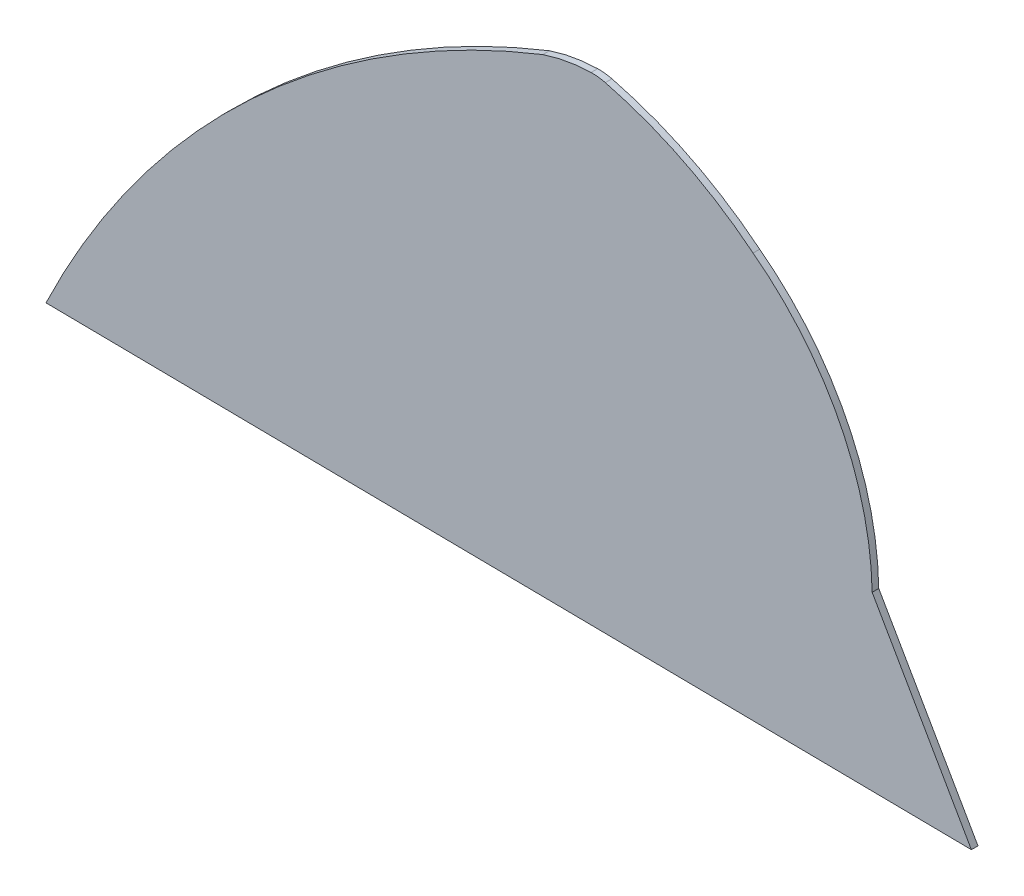
ISO-10303-21;
HEADER;
FILE_DESCRIPTION(('STEP AP214'),'2;1');
FILE_NAME('part.step','',(''),(''),'','','');
FILE_SCHEMA(('AUTOMOTIVE_DESIGN { 1 0 10303 214 1 1 1 1 }'));
ENDSEC;
DATA;
#1=APPLICATION_CONTEXT('core data for automotive mechanical design processes');
#2=APPLICATION_PROTOCOL_DEFINITION('international standard','automotive_design',2000,#1);
#3=PRODUCT_CONTEXT('',#1,'mechanical');
#4=PRODUCT('Part','Part','',(#3));
#5=PRODUCT_RELATED_PRODUCT_CATEGORY('part','',(#4));
#6=PRODUCT_DEFINITION_FORMATION('','',#4);
#7=PRODUCT_DEFINITION_CONTEXT('part definition',#1,'design');
#8=PRODUCT_DEFINITION('design','',#6,#7);
#9=PRODUCT_DEFINITION_SHAPE('','',#8);
#10=(LENGTH_UNIT() NAMED_UNIT(*) SI_UNIT(.MILLI.,.METRE.));
#11=(NAMED_UNIT(*) PLANE_ANGLE_UNIT() SI_UNIT($,.RADIAN.));
#12=(NAMED_UNIT(*) SI_UNIT($,.STERADIAN.) SOLID_ANGLE_UNIT());
#13=UNCERTAINTY_MEASURE_WITH_UNIT(LENGTH_MEASURE(1.E-05),#10,'distance_accuracy_value','');
#14=(GEOMETRIC_REPRESENTATION_CONTEXT(3) GLOBAL_UNCERTAINTY_ASSIGNED_CONTEXT((#13)) GLOBAL_UNIT_ASSIGNED_CONTEXT((#10,
#11,#12)) REPRESENTATION_CONTEXT('',''));
#15=CARTESIAN_POINT('',(0.,0.,0.));
#16=DIRECTION('',(0.,0.,1.));
#17=DIRECTION('',(1.,0.,0.));
#18=AXIS2_PLACEMENT_3D('',#15,#16,#17);
#19=CARTESIAN_POINT('',(535.988635979813,-603.910391378545,10.));
#20=DIRECTION('',(0.,0.,-1.));
#21=DIRECTION('',(-1.,0.,0.));
#22=AXIS2_PLACEMENT_3D('',#19,#20,#21);
#23=CYLINDRICAL_SURFACE('',#22,1410.55303377677);
#24=CARTESIAN_POINT('',(535.988635979813,-603.910391378545,0.));
#25=DIRECTION('',(0.,0.,1.));
#26=DIRECTION('',(1.,0.,0.));
#27=AXIS2_PLACEMENT_3D('',#24,#25,#26);
#28=CIRCLE('',#27,1410.55303377677);
#29=CARTESIAN_POINT('',(-735.852954333982,6.07225611638478,0.));
#30=VERTEX_POINT('',#29);
#31=CARTESIAN_POINT('',(15.9002478846662,707.260051266284,0.));
#32=VERTEX_POINT('',#31);
#33=EDGE_CURVE('E127',#30,#32,#28,.F.);
#34=ORIENTED_EDGE('',*,*,#33,.F.);
#35=DIRECTION('',(0.,0.,-1.));
#36=VECTOR('',#35,1.);
#37=CARTESIAN_POINT('',(-735.852954333982,6.07225611638478,10.));
#38=LINE('',#37,#36);
#39=CARTESIAN_POINT('',(-735.852954333982,6.07225611638478,10.));
#40=VERTEX_POINT('',#39);
#41=EDGE_CURVE('E12',#40,#30,#38,.T.);
#42=ORIENTED_EDGE('',*,*,#41,.F.);
#43=CARTESIAN_POINT('',(535.988635979813,-603.910391378545,10.));
#44=DIRECTION('',(0.,0.,1.));
#45=DIRECTION('',(1.,0.,0.));
#46=AXIS2_PLACEMENT_3D('',#43,#44,#45);
#47=CIRCLE('',#46,1410.55303377677);
#48=CARTESIAN_POINT('',(15.9002478846662,707.260051266284,10.));
#49=VERTEX_POINT('',#48);
#50=EDGE_CURVE('E143',#40,#49,#47,.F.);
#51=ORIENTED_EDGE('',*,*,#50,.T.);
#52=DIRECTION('',(0.,0.,-1.));
#53=VECTOR('',#52,1.);
#54=CARTESIAN_POINT('',(15.9002478846662,707.260051266284,10.));
#55=LINE('',#54,#53);
#56=EDGE_CURVE('E53',#49,#32,#55,.T.);
#57=ORIENTED_EDGE('',*,*,#56,.T.);
#58=EDGE_LOOP('',(#34,#42,#51,#57));
#59=FACE_BOUND('',#58,.T.);
#60=ADVANCED_FACE('F37',(#59),#23,.T.);
#61=CARTESIAN_POINT('',(-0.0306658305550728,-2.60148448646122,10.));
#62=DIRECTION('',(0.0117870009937492,0.999930530890808,0.));
#63=DIRECTION('',(-0.999930530890808,0.0117870009937492,0.));
#64=AXIS2_PLACEMENT_3D('',#61,#62,#63);
#65=PLANE('',#64);
#66=DIRECTION('',(0.999930530890808,-0.0117870009937492,0.));
#67=VECTOR('',#66,1.);
#68=CARTESIAN_POINT('',(-0.0306658305550728,-2.60148448646122,0.));
#69=LINE('',#68,#67);
#70=CARTESIAN_POINT('',(664.147045666018,-10.4306917199496,0.));
#71=VERTEX_POINT('',#70);
#72=EDGE_CURVE('E129',#30,#71,#69,.T.);
#73=ORIENTED_EDGE('',*,*,#72,.T.);
#74=DIRECTION('',(0.,0.,-1.));
#75=VECTOR('',#74,1.);
#76=CARTESIAN_POINT('',(664.147045666018,-10.4306917199496,10.));
#77=LINE('',#76,#75);
#78=CARTESIAN_POINT('',(664.147045666018,-10.4306917199496,10.));
#79=VERTEX_POINT('',#78);
#80=EDGE_CURVE('E45',#79,#71,#77,.T.);
#81=ORIENTED_EDGE('',*,*,#80,.F.);
#82=DIRECTION('',(0.999930530890808,-0.0117870009937492,0.));
#83=VECTOR('',#82,1.);
#84=CARTESIAN_POINT('',(-0.0306658305550728,-2.60148448646122,10.));
#85=LINE('',#84,#83);
#86=EDGE_CURVE('E165',#40,#79,#85,.T.);
#87=ORIENTED_EDGE('',*,*,#86,.F.);
#88=ORIENTED_EDGE('',*,*,#41,.T.);
#89=EDGE_LOOP('',(#73,#81,#87,#88));
#90=FACE_BOUND('',#89,.T.);
#91=ADVANCED_FACE('F183',(#90),#65,.F.);
#92=CARTESIAN_POINT('',(495.659031522961,283.817188201182,10.));
#93=DIRECTION('',(-0.867802762086588,-0.496908810663374,0.));
#94=DIRECTION('',(0.496908810663374,-0.867802762086588,0.));
#95=AXIS2_PLACEMENT_3D('',#92,#93,#94);
#96=PLANE('',#95);
#97=DIRECTION('',(-0.496908810663374,0.867802762086588,0.));
#98=VECTOR('',#97,1.);
#99=CARTESIAN_POINT('',(495.659031522961,283.817188201182,0.));
#100=LINE('',#99,#98);
#101=CARTESIAN_POINT('',(514.004259651077,251.779036936698,0.));
#102=VERTEX_POINT('',#101);
#103=EDGE_CURVE('E131',#71,#102,#100,.T.);
#104=ORIENTED_EDGE('',*,*,#103,.T.);
#105=DIRECTION('',(0.,0.,-1.));
#106=VECTOR('',#105,1.);
#107=CARTESIAN_POINT('',(514.004259651077,251.779036936698,10.));
#108=LINE('',#107,#106);
#109=CARTESIAN_POINT('',(514.004259651077,251.779036936698,10.));
#110=VERTEX_POINT('',#109);
#111=EDGE_CURVE('E147',#110,#102,#108,.T.);
#112=ORIENTED_EDGE('',*,*,#111,.F.);
#113=DIRECTION('',(-0.496908810663374,0.867802762086588,0.));
#114=VECTOR('',#113,1.);
#115=CARTESIAN_POINT('',(495.659031522961,283.817188201182,10.));
#116=LINE('',#115,#114);
#117=EDGE_CURVE('E155',#79,#110,#116,.T.);
#118=ORIENTED_EDGE('',*,*,#117,.F.);
#119=ORIENTED_EDGE('',*,*,#80,.T.);
#120=EDGE_LOOP('',(#104,#112,#118,#119));
#121=FACE_BOUND('',#120,.T.);
#122=ADVANCED_FACE('F153',(#121),#96,.F.);
#123=CARTESIAN_POINT('',(60.4859703411848,244.303887462384,10.));
#124=DIRECTION('',(0.,0.,-1.));
#125=DIRECTION('',(-1.,0.,0.));
#126=AXIS2_PLACEMENT_3D('',#123,#124,#125);
#127=CYLINDRICAL_SURFACE('',#126,453.579889984372);
#128=CARTESIAN_POINT('',(60.4859703411848,244.303887462384,0.));
#129=DIRECTION('',(0.,0.,1.));
#130=DIRECTION('',(1.,0.,0.));
#131=AXIS2_PLACEMENT_3D('',#128,#129,#130);
#132=CIRCLE('',#131,453.579889984372);
#133=CARTESIAN_POINT('',(333.892309544586,606.220577159929,0.));
#134=VERTEX_POINT('',#133);
#135=EDGE_CURVE('E134',#134,#102,#132,.F.);
#136=ORIENTED_EDGE('',*,*,#135,.F.);
#137=DIRECTION('',(0.,0.,-1.));
#138=VECTOR('',#137,1.);
#139=CARTESIAN_POINT('',(333.892309544586,606.220577159929,10.));
#140=LINE('',#139,#138);
#141=CARTESIAN_POINT('',(333.892309544586,606.220577159929,10.));
#142=VERTEX_POINT('',#141);
#143=EDGE_CURVE('E106',#142,#134,#140,.T.);
#144=ORIENTED_EDGE('',*,*,#143,.F.);
#145=CARTESIAN_POINT('',(60.4859703411848,244.303887462384,10.));
#146=DIRECTION('',(0.,0.,1.));
#147=DIRECTION('',(1.,0.,0.));
#148=AXIS2_PLACEMENT_3D('',#145,#146,#147);
#149=CIRCLE('',#148,453.579889984372);
#150=EDGE_CURVE('E116',#142,#110,#149,.F.);
#151=ORIENTED_EDGE('',*,*,#150,.T.);
#152=ORIENTED_EDGE('',*,*,#111,.T.);
#153=EDGE_LOOP('',(#136,#144,#151,#152));
#154=FACE_BOUND('',#153,.T.);
#155=ADVANCED_FACE('F162',(#154),#127,.T.);
#156=CARTESIAN_POINT('',(-33.6900557474857,149.132464711792,10.));
#157=DIRECTION('',(0.,0.,-1.));
#158=DIRECTION('',(-1.,0.,0.));
#159=AXIS2_PLACEMENT_3D('',#156,#157,#158);
#160=CYLINDRICAL_SURFACE('',#159,586.55463327393);
#161=CARTESIAN_POINT('',(-33.6900557474857,149.132464711792,0.));
#162=DIRECTION('',(0.,0.,1.));
#163=DIRECTION('',(1.,0.,0.));
#164=AXIS2_PLACEMENT_3D('',#161,#162,#163);
#165=CIRCLE('',#164,586.55463327393);
#166=CARTESIAN_POINT('',(110.348718238951,717.726493350503,0.));
#167=VERTEX_POINT('',#166);
#168=EDGE_CURVE('E102',#167,#134,#165,.F.);
#169=ORIENTED_EDGE('',*,*,#168,.F.);
#170=DIRECTION('',(0.,0.,-1.));
#171=VECTOR('',#170,1.);
#172=CARTESIAN_POINT('',(110.348718238951,717.726493350503,10.));
#173=LINE('',#172,#171);
#174=CARTESIAN_POINT('',(110.348718238951,717.726493350503,10.));
#175=VERTEX_POINT('',#174);
#176=EDGE_CURVE('E97',#175,#167,#173,.T.);
#177=ORIENTED_EDGE('',*,*,#176,.F.);
#178=CARTESIAN_POINT('',(-33.6900557474857,149.132464711792,10.));
#179=DIRECTION('',(0.,0.,1.));
#180=DIRECTION('',(1.,0.,0.));
#181=AXIS2_PLACEMENT_3D('',#178,#179,#180);
#182=CIRCLE('',#181,586.55463327393);
#183=EDGE_CURVE('E100',#175,#142,#182,.F.);
#184=ORIENTED_EDGE('',*,*,#183,.T.);
#185=ORIENTED_EDGE('',*,*,#143,.T.);
#186=EDGE_LOOP('',(#169,#177,#184,#185));
#187=FACE_BOUND('',#186,.T.);
#188=ADVANCED_FACE('F99',(#187),#160,.T.);
#189=CARTESIAN_POINT('',(90.7033156366439,640.17613450805,10.));
#190=DIRECTION('',(0.,0.,-1.));
#191=DIRECTION('',(-1.,0.,0.));
#192=AXIS2_PLACEMENT_3D('',#189,#190,#191);
#193=CYLINDRICAL_SURFACE('',#192,80.);
#194=CARTESIAN_POINT('',(90.7033156366439,640.17613450805,0.));
#195=DIRECTION('',(0.,0.,1.));
#196=DIRECTION('',(1.,0.,0.));
#197=AXIS2_PLACEMENT_3D('',#194,#195,#196);
#198=CIRCLE('',#197,80.);
#199=CARTESIAN_POINT('',(88.7538771678541,720.152379041388,0.));
#200=VERTEX_POINT('',#199);
#201=EDGE_CURVE('E138',#200,#167,#198,.F.);
#202=ORIENTED_EDGE('',*,*,#201,.F.);
#203=DIRECTION('',(0.,0.,-1.));
#204=VECTOR('',#203,1.);
#205=CARTESIAN_POINT('',(88.7538771678541,720.152379041388,10.));
#206=LINE('',#205,#204);
#207=CARTESIAN_POINT('',(88.7538771678541,720.152379041388,10.));
#208=VERTEX_POINT('',#207);
#209=EDGE_CURVE('E75',#208,#200,#206,.T.);
#210=ORIENTED_EDGE('',*,*,#209,.F.);
#211=CARTESIAN_POINT('',(90.7033156366439,640.17613450805,10.));
#212=DIRECTION('',(0.,0.,1.));
#213=DIRECTION('',(1.,0.,0.));
#214=AXIS2_PLACEMENT_3D('',#211,#212,#213);
#215=CIRCLE('',#214,80.);
#216=EDGE_CURVE('E114',#208,#175,#215,.F.);
#217=ORIENTED_EDGE('',*,*,#216,.T.);
#218=ORIENTED_EDGE('',*,*,#176,.T.);
#219=EDGE_LOOP('',(#202,#210,#217,#218));
#220=FACE_BOUND('',#219,.T.);
#221=ADVANCED_FACE('F119',(#220),#193,.T.);
#222=CARTESIAN_POINT('',(94.7551619119924,473.948036665121,10.));
#223=DIRECTION('',(0.,0.,-1.));
#224=DIRECTION('',(-1.,0.,0.));
#225=AXIS2_PLACEMENT_3D('',#222,#223,#224);
#226=CYLINDRICAL_SURFACE('',#225,246.277472829957);
#227=CARTESIAN_POINT('',(94.7551619119924,473.948036665121,0.));
#228=DIRECTION('',(0.,0.,1.));
#229=DIRECTION('',(1.,0.,0.));
#230=AXIS2_PLACEMENT_3D('',#227,#228,#229);
#231=CIRCLE('',#230,246.277472829957);
#232=EDGE_CURVE('E140',#32,#200,#231,.F.);
#233=ORIENTED_EDGE('',*,*,#232,.F.);
#234=ORIENTED_EDGE('',*,*,#56,.F.);
#235=CARTESIAN_POINT('',(94.7551619119924,473.948036665121,10.));
#236=DIRECTION('',(0.,0.,1.));
#237=DIRECTION('',(1.,0.,0.));
#238=AXIS2_PLACEMENT_3D('',#235,#236,#237);
#239=CIRCLE('',#238,246.277472829957);
#240=EDGE_CURVE('E121',#49,#208,#239,.F.);
#241=ORIENTED_EDGE('',*,*,#240,.T.);
#242=ORIENTED_EDGE('',*,*,#209,.T.);
#243=EDGE_LOOP('',(#233,#234,#241,#242));
#244=FACE_BOUND('',#243,.T.);
#245=ADVANCED_FACE('F172',(#244),#226,.T.);
#246=CARTESIAN_POINT('',(0.,0.,10.));
#247=DIRECTION('',(0.,0.,1.));
#248=DIRECTION('',(1.,0.,0.));
#249=AXIS2_PLACEMENT_3D('',#246,#247,#248);
#250=PLANE('',#249);
#251=ORIENTED_EDGE('',*,*,#50,.F.);
#252=ORIENTED_EDGE('',*,*,#86,.T.);
#253=ORIENTED_EDGE('',*,*,#117,.T.);
#254=ORIENTED_EDGE('',*,*,#150,.F.);
#255=ORIENTED_EDGE('',*,*,#183,.F.);
#256=ORIENTED_EDGE('',*,*,#216,.F.);
#257=ORIENTED_EDGE('',*,*,#240,.F.);
#258=EDGE_LOOP('',(#251,#252,#253,#254,#255,#256,#257));
#259=FACE_BOUND('',#258,.T.);
#260=ADVANCED_FACE('F112',(#259),#250,.T.);
#261=CARTESIAN_POINT('',(0.,0.,0.));
#262=DIRECTION('',(0.,0.,1.));
#263=DIRECTION('',(1.,0.,0.));
#264=AXIS2_PLACEMENT_3D('',#261,#262,#263);
#265=PLANE('',#264);
#266=ORIENTED_EDGE('',*,*,#33,.T.);
#267=ORIENTED_EDGE('',*,*,#232,.T.);
#268=ORIENTED_EDGE('',*,*,#201,.T.);
#269=ORIENTED_EDGE('',*,*,#168,.T.);
#270=ORIENTED_EDGE('',*,*,#135,.T.);
#271=ORIENTED_EDGE('',*,*,#103,.F.);
#272=ORIENTED_EDGE('',*,*,#72,.F.);
#273=EDGE_LOOP('',(#266,#267,#268,#269,#270,#271,#272));
#274=FACE_BOUND('',#273,.T.);
#275=ADVANCED_FACE('F159',(#274),#265,.F.);
#276=CLOSED_SHELL('',(#60,#91,#122,#155,#188,#221,#245,#260,#275));
#277=MANIFOLD_SOLID_BREP('B2',#276);
#278=ADVANCED_BREP_SHAPE_REPRESENTATION('',(#18,#277),#14);
#279=SHAPE_DEFINITION_REPRESENTATION(#9,#278);
ENDSEC;
END-ISO-10303-21;
